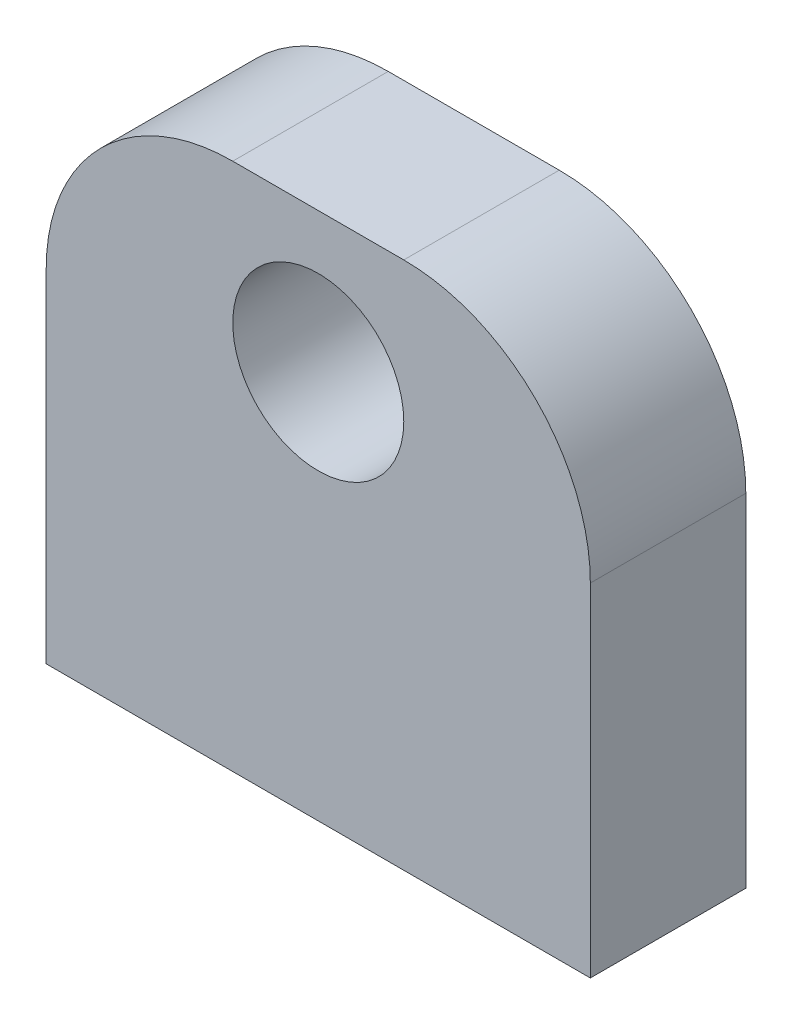
ISO-10303-21;
HEADER;
FILE_DESCRIPTION(('STEP AP214'),'2;1');
FILE_NAME('part.step','',(''),(''),'','','');
FILE_SCHEMA(('AUTOMOTIVE_DESIGN { 1 0 10303 214 1 1 1 1 }'));
ENDSEC;
DATA;
#1=APPLICATION_CONTEXT('core data for automotive mechanical design processes');
#2=APPLICATION_PROTOCOL_DEFINITION('international standard','automotive_design',2000,#1);
#3=PRODUCT_CONTEXT('',#1,'mechanical');
#4=PRODUCT('Part','Part','',(#3));
#5=PRODUCT_RELATED_PRODUCT_CATEGORY('part','',(#4));
#6=PRODUCT_DEFINITION_FORMATION('','',#4);
#7=PRODUCT_DEFINITION_CONTEXT('part definition',#1,'design');
#8=PRODUCT_DEFINITION('design','',#6,#7);
#9=PRODUCT_DEFINITION_SHAPE('','',#8);
#10=(LENGTH_UNIT() NAMED_UNIT(*) SI_UNIT(.MILLI.,.METRE.));
#11=(NAMED_UNIT(*) PLANE_ANGLE_UNIT() SI_UNIT($,.RADIAN.));
#12=(NAMED_UNIT(*) SI_UNIT($,.STERADIAN.) SOLID_ANGLE_UNIT());
#13=UNCERTAINTY_MEASURE_WITH_UNIT(LENGTH_MEASURE(1.E-05),#10,'distance_accuracy_value','');
#14=(GEOMETRIC_REPRESENTATION_CONTEXT(3) GLOBAL_UNCERTAINTY_ASSIGNED_CONTEXT((#13)) GLOBAL_UNIT_ASSIGNED_CONTEXT((#10,
#11,#12)) REPRESENTATION_CONTEXT('',''));
#15=CARTESIAN_POINT('',(0.,0.,0.));
#16=DIRECTION('',(0.,0.,1.));
#17=DIRECTION('',(1.,0.,0.));
#18=AXIS2_PLACEMENT_3D('',#15,#16,#17);
#19=CARTESIAN_POINT('',(-16.3353241489162,34.,-9.14482917573461));
#20=DIRECTION('',(1.,0.,0.));
#21=DIRECTION('',(0.,0.,-1.));
#22=AXIS2_PLACEMENT_3D('',#19,#20,#21);
#23=PLANE('',#22);
#24=DIRECTION('',(0.,-1.,0.));
#25=VECTOR('',#24,1.);
#26=CARTESIAN_POINT('',(-16.3353241489162,34.,0.855170824265387));
#27=LINE('',#26,#25);
#28=CARTESIAN_POINT('',(-16.3353241489162,22.,0.855170824265387));
#29=VERTEX_POINT('',#28);
#30=CARTESIAN_POINT('',(-16.3353241489162,0.,0.855170824265387));
#31=VERTEX_POINT('',#30);
#32=EDGE_CURVE('E84',#29,#31,#27,.T.);
#33=ORIENTED_EDGE('',*,*,#32,.F.);
#34=DIRECTION('',(0.,0.,1.));
#35=VECTOR('',#34,1.);
#36=CARTESIAN_POINT('',(-16.3353241489162,22.,-9.14482917573461));
#37=LINE('',#36,#35);
#38=CARTESIAN_POINT('',(-16.3353241489162,22.,-9.14482917573461));
#39=VERTEX_POINT('',#38);
#40=EDGE_CURVE('E11',#29,#39,#37,.F.);
#41=ORIENTED_EDGE('',*,*,#40,.T.);
#42=DIRECTION('',(0.,-1.,0.));
#43=VECTOR('',#42,1.);
#44=CARTESIAN_POINT('',(-16.3353241489162,34.,-9.14482917573461));
#45=LINE('',#44,#43);
#46=CARTESIAN_POINT('',(-16.3353241489162,0.,-9.14482917573461));
#47=VERTEX_POINT('',#46);
#48=EDGE_CURVE('E104',#39,#47,#45,.T.);
#49=ORIENTED_EDGE('',*,*,#48,.T.);
#50=DIRECTION('',(0.,0.,1.));
#51=VECTOR('',#50,1.);
#52=CARTESIAN_POINT('',(-16.3353241489162,0.,-9.14482917573461));
#53=LINE('',#52,#51);
#54=EDGE_CURVE('E99',#47,#31,#53,.T.);
#55=ORIENTED_EDGE('',*,*,#54,.T.);
#56=EDGE_LOOP('',(#33,#41,#49,#55));
#57=FACE_BOUND('',#56,.T.);
#58=ADVANCED_FACE('F33',(#57),#23,.F.);
#59=CARTESIAN_POINT('',(-16.3353241489162,34.,0.855170824265387));
#60=DIRECTION('',(0.,0.,-1.));
#61=DIRECTION('',(-1.,0.,0.));
#62=AXIS2_PLACEMENT_3D('',#59,#60,#61);
#63=PLANE('',#62);
#64=CARTESIAN_POINT('',(1.16467585108376,25.,0.855170824265387));
#65=DIRECTION('',(0.,0.,1.));
#66=DIRECTION('',(1.,0.,0.));
#67=AXIS2_PLACEMENT_3D('',#64,#65,#66);
#68=CIRCLE('',#67,5.5);
#69=CARTESIAN_POINT('',(6.66467585108376,25.,0.855170824265387));
#70=VERTEX_POINT('',#69);
#71=EDGE_CURVE('E109',#70,#70,#68,.T.);
#72=ORIENTED_EDGE('',*,*,#71,.F.);
#73=EDGE_LOOP('',(#72));
#74=FACE_BOUND('',#73,.T.);
#75=DIRECTION('',(0.,-1.,0.));
#76=VECTOR('',#75,1.);
#77=CARTESIAN_POINT('',(18.6646758510838,34.,0.855170824265387));
#78=LINE('',#77,#76);
#79=CARTESIAN_POINT('',(18.6646758510838,22.,0.855170824265387));
#80=VERTEX_POINT('',#79);
#81=CARTESIAN_POINT('',(18.6646758510838,0.,0.855170824265387));
#82=VERTEX_POINT('',#81);
#83=EDGE_CURVE('E93',#80,#82,#78,.T.);
#84=ORIENTED_EDGE('',*,*,#83,.F.);
#85=CARTESIAN_POINT('',(6.66467585108376,22.,0.855170824265387));
#86=DIRECTION('',(0.,0.,-1.));
#87=DIRECTION('',(-1.,0.,0.));
#88=AXIS2_PLACEMENT_3D('',#85,#86,#87);
#89=CIRCLE('',#88,12.);
#90=CARTESIAN_POINT('',(6.66467585108376,34.,0.855170824265387));
#91=VERTEX_POINT('',#90);
#92=EDGE_CURVE('E41',#80,#91,#89,.F.);
#93=ORIENTED_EDGE('',*,*,#92,.T.);
#94=DIRECTION('',(1.,0.,0.));
#95=VECTOR('',#94,1.);
#96=CARTESIAN_POINT('',(-16.3353241489162,34.,0.855170824265387));
#97=LINE('',#96,#95);
#98=CARTESIAN_POINT('',(-4.33532414891625,34.,0.855170824265387));
#99=VERTEX_POINT('',#98);
#100=EDGE_CURVE('E118',#99,#91,#97,.T.);
#101=ORIENTED_EDGE('',*,*,#100,.F.);
#102=CARTESIAN_POINT('',(-4.33532414891625,22.,0.855170824265387));
#103=DIRECTION('',(0.,0.,-1.));
#104=DIRECTION('',(-1.,0.,0.));
#105=AXIS2_PLACEMENT_3D('',#102,#103,#104);
#106=CIRCLE('',#105,12.);
#107=EDGE_CURVE('E48',#99,#29,#106,.F.);
#108=ORIENTED_EDGE('',*,*,#107,.T.);
#109=ORIENTED_EDGE('',*,*,#32,.T.);
#110=DIRECTION('',(1.,0.,0.));
#111=VECTOR('',#110,1.);
#112=CARTESIAN_POINT('',(-16.3353241489162,0.,0.855170824265387));
#113=LINE('',#112,#111);
#114=EDGE_CURVE('E87',#31,#82,#113,.T.);
#115=ORIENTED_EDGE('',*,*,#114,.T.);
#116=EDGE_LOOP('',(#84,#93,#101,#108,#109,#115));
#117=FACE_BOUND('',#116,.T.);
#118=ADVANCED_FACE('F86',(#74,#117),#63,.F.);
#119=CARTESIAN_POINT('',(18.6646758510838,34.,-9.14482917573461));
#120=DIRECTION('',(-1.,0.,0.));
#121=DIRECTION('',(0.,0.,1.));
#122=AXIS2_PLACEMENT_3D('',#119,#120,#121);
#123=PLANE('',#122);
#124=DIRECTION('',(0.,-1.,0.));
#125=VECTOR('',#124,1.);
#126=CARTESIAN_POINT('',(18.6646758510838,34.,-9.14482917573461));
#127=LINE('',#126,#125);
#128=CARTESIAN_POINT('',(18.6646758510838,22.,-9.14482917573461));
#129=VERTEX_POINT('',#128);
#130=CARTESIAN_POINT('',(18.6646758510838,0.,-9.14482917573461));
#131=VERTEX_POINT('',#130);
#132=EDGE_CURVE('E120',#129,#131,#127,.T.);
#133=ORIENTED_EDGE('',*,*,#132,.F.);
#134=DIRECTION('',(0.,0.,-1.));
#135=VECTOR('',#134,1.);
#136=CARTESIAN_POINT('',(18.6646758510838,22.,0.855170824265387));
#137=LINE('',#136,#135);
#138=EDGE_CURVE('E56',#129,#80,#137,.F.);
#139=ORIENTED_EDGE('',*,*,#138,.T.);
#140=ORIENTED_EDGE('',*,*,#83,.T.);
#141=DIRECTION('',(0.,0.,-1.));
#142=VECTOR('',#141,1.);
#143=CARTESIAN_POINT('',(18.6646758510838,0.,-9.14482917573461));
#144=LINE('',#143,#142);
#145=EDGE_CURVE('E101',#82,#131,#144,.T.);
#146=ORIENTED_EDGE('',*,*,#145,.T.);
#147=EDGE_LOOP('',(#133,#139,#140,#146));
#148=FACE_BOUND('',#147,.T.);
#149=ADVANCED_FACE('F145',(#148),#123,.F.);
#150=CARTESIAN_POINT('',(-16.3353241489162,34.,-9.14482917573461));
#151=DIRECTION('',(0.,0.,1.));
#152=DIRECTION('',(1.,0.,0.));
#153=AXIS2_PLACEMENT_3D('',#150,#151,#152);
#154=PLANE('',#153);
#155=CARTESIAN_POINT('',(1.16467585108376,25.,-9.14482917573461));
#156=DIRECTION('',(0.,0.,1.));
#157=DIRECTION('',(1.,0.,0.));
#158=AXIS2_PLACEMENT_3D('',#155,#156,#157);
#159=CIRCLE('',#158,5.5);
#160=CARTESIAN_POINT('',(6.66467585108376,25.,-9.14482917573461));
#161=VERTEX_POINT('',#160);
#162=EDGE_CURVE('E106',#161,#161,#159,.T.);
#163=ORIENTED_EDGE('',*,*,#162,.T.);
#164=EDGE_LOOP('',(#163));
#165=FACE_BOUND('',#164,.T.);
#166=DIRECTION('',(-1.,0.,0.));
#167=VECTOR('',#166,1.);
#168=CARTESIAN_POINT('',(-16.3353241489162,34.,-9.14482917573461));
#169=LINE('',#168,#167);
#170=CARTESIAN_POINT('',(6.66467585108376,34.,-9.14482917573461));
#171=VERTEX_POINT('',#170);
#172=CARTESIAN_POINT('',(-4.33532414891625,34.,-9.14482917573461));
#173=VERTEX_POINT('',#172);
#174=EDGE_CURVE('E112',#171,#173,#169,.T.);
#175=ORIENTED_EDGE('',*,*,#174,.F.);
#176=CARTESIAN_POINT('',(6.66467585108376,22.,-9.14482917573461));
#177=DIRECTION('',(0.,0.,1.));
#178=DIRECTION('',(1.,0.,0.));
#179=AXIS2_PLACEMENT_3D('',#176,#177,#178);
#180=CIRCLE('',#179,12.);
#181=EDGE_CURVE('E130',#171,#129,#180,.F.);
#182=ORIENTED_EDGE('',*,*,#181,.T.);
#183=ORIENTED_EDGE('',*,*,#132,.T.);
#184=DIRECTION('',(-1.,0.,0.));
#185=VECTOR('',#184,1.);
#186=CARTESIAN_POINT('',(-16.3353241489162,0.,-9.14482917573461));
#187=LINE('',#186,#185);
#188=EDGE_CURVE('E116',#131,#47,#187,.T.);
#189=ORIENTED_EDGE('',*,*,#188,.T.);
#190=ORIENTED_EDGE('',*,*,#48,.F.);
#191=CARTESIAN_POINT('',(-4.33532414891625,22.,-9.14482917573461));
#192=DIRECTION('',(0.,0.,1.));
#193=DIRECTION('',(1.,0.,0.));
#194=AXIS2_PLACEMENT_3D('',#191,#192,#193);
#195=CIRCLE('',#194,12.);
#196=EDGE_CURVE('E128',#39,#173,#195,.F.);
#197=ORIENTED_EDGE('',*,*,#196,.T.);
#198=EDGE_LOOP('',(#175,#182,#183,#189,#190,#197));
#199=FACE_BOUND('',#198,.T.);
#200=ADVANCED_FACE('F144',(#165,#199),#154,.F.);
#201=CARTESIAN_POINT('',(0.,34.,0.));
#202=DIRECTION('',(0.,1.,0.));
#203=DIRECTION('',(0.,0.,1.));
#204=AXIS2_PLACEMENT_3D('',#201,#202,#203);
#205=PLANE('',#204);
#206=ORIENTED_EDGE('',*,*,#100,.T.);
#207=DIRECTION('',(0.,0.,-1.));
#208=VECTOR('',#207,1.);
#209=CARTESIAN_POINT('',(6.66467585108376,34.,-9.14482917573461));
#210=LINE('',#209,#208);
#211=EDGE_CURVE('E125',#91,#171,#210,.T.);
#212=ORIENTED_EDGE('',*,*,#211,.T.);
#213=ORIENTED_EDGE('',*,*,#174,.T.);
#214=DIRECTION('',(0.,0.,1.));
#215=VECTOR('',#214,1.);
#216=CARTESIAN_POINT('',(-4.33532414891625,34.,0.855170824265383));
#217=LINE('',#216,#215);
#218=EDGE_CURVE('E92',#173,#99,#217,.T.);
#219=ORIENTED_EDGE('',*,*,#218,.T.);
#220=EDGE_LOOP('',(#206,#212,#213,#219));
#221=FACE_BOUND('',#220,.T.);
#222=ADVANCED_FACE('F138',(#221),#205,.T.);
#223=CARTESIAN_POINT('',(0.,0.,0.));
#224=DIRECTION('',(0.,1.,0.));
#225=DIRECTION('',(0.,0.,1.));
#226=AXIS2_PLACEMENT_3D('',#223,#224,#225);
#227=PLANE('',#226);
#228=CARTESIAN_POINT('',(10.6646758510838,0.,-4.14482917573461));
#229=DIRECTION('',(0.,-1.,0.));
#230=DIRECTION('',(0.,0.,-1.));
#231=AXIS2_PLACEMENT_3D('',#228,#229,#230);
#232=CIRCLE('',#231,1.75);
#233=CARTESIAN_POINT('',(10.6646758510838,0.,-5.89482917573461));
#234=VERTEX_POINT('',#233);
#235=EDGE_CURVE('E195',#234,#234,#232,.T.);
#236=ORIENTED_EDGE('',*,*,#235,.F.);
#237=EDGE_LOOP('',(#236));
#238=FACE_BOUND('',#237,.T.);
#239=CARTESIAN_POINT('',(-8.33532414891625,0.,-4.14482917573461));
#240=DIRECTION('',(0.,-1.,0.));
#241=DIRECTION('',(0.,0.,-1.));
#242=AXIS2_PLACEMENT_3D('',#239,#240,#241);
#243=CIRCLE('',#242,1.75);
#244=CARTESIAN_POINT('',(-8.33532414891625,0.,-5.89482917573461));
#245=VERTEX_POINT('',#244);
#246=EDGE_CURVE('E194',#245,#245,#243,.T.);
#247=ORIENTED_EDGE('',*,*,#246,.F.);
#248=EDGE_LOOP('',(#247));
#249=FACE_BOUND('',#248,.T.);
#250=ORIENTED_EDGE('',*,*,#54,.F.);
#251=ORIENTED_EDGE('',*,*,#188,.F.);
#252=ORIENTED_EDGE('',*,*,#145,.F.);
#253=ORIENTED_EDGE('',*,*,#114,.F.);
#254=EDGE_LOOP('',(#250,#251,#252,#253));
#255=FACE_BOUND('',#254,.T.);
#256=ADVANCED_FACE('F97',(#238,#249,#255),#227,.F.);
#257=CARTESIAN_POINT('',(1.16467585108376,25.,-9.14482917573461));
#258=DIRECTION('',(0.,0.,1.));
#259=DIRECTION('',(1.,0.,0.));
#260=AXIS2_PLACEMENT_3D('',#257,#258,#259);
#261=CYLINDRICAL_SURFACE('',#260,5.5);
#262=ORIENTED_EDGE('',*,*,#162,.F.);
#263=EDGE_LOOP('',(#262));
#264=FACE_BOUND('',#263,.T.);
#265=ORIENTED_EDGE('',*,*,#71,.T.);
#266=EDGE_LOOP('',(#265));
#267=FACE_BOUND('',#266,.T.);
#268=ADVANCED_FACE('F168',(#264,#267),#261,.F.);
#269=CARTESIAN_POINT('',(-8.33532414891625,10.,-4.14482917573461));
#270=DIRECTION('',(0.,-1.,0.));
#271=DIRECTION('',(0.,0.,-1.));
#272=AXIS2_PLACEMENT_3D('',#269,#270,#271);
#273=CYLINDRICAL_SURFACE('',#272,1.75);
#274=CARTESIAN_POINT('',(-8.33532414891625,10.,-4.14482917573461));
#275=DIRECTION('',(0.,-1.,0.));
#276=DIRECTION('',(0.,0.,-1.));
#277=AXIS2_PLACEMENT_3D('',#274,#275,#276);
#278=CIRCLE('',#277,1.75);
#279=CARTESIAN_POINT('',(-8.33532414891625,10.,-5.89482917573461));
#280=VERTEX_POINT('',#279);
#281=EDGE_CURVE('E198',#280,#280,#278,.T.);
#282=ORIENTED_EDGE('',*,*,#281,.F.);
#283=EDGE_LOOP('',(#282));
#284=FACE_BOUND('',#283,.T.);
#285=ORIENTED_EDGE('',*,*,#246,.T.);
#286=EDGE_LOOP('',(#285));
#287=FACE_BOUND('',#286,.T.);
#288=ADVANCED_FACE('F174',(#284,#287),#273,.F.);
#289=CARTESIAN_POINT('',(-8.33532414891625,10.,-4.14482917573461));
#290=DIRECTION('',(0.,-1.,0.));
#291=DIRECTION('',(0.,0.,-1.));
#292=AXIS2_PLACEMENT_3D('',#289,#290,#291);
#293=PLANE('',#292);
#294=ORIENTED_EDGE('',*,*,#281,.T.);
#295=EDGE_LOOP('',(#294));
#296=FACE_BOUND('',#295,.T.);
#297=ADVANCED_FACE('F178',(#296),#293,.T.);
#298=CARTESIAN_POINT('',(10.6646758510838,10.,-4.14482917573461));
#299=DIRECTION('',(0.,-1.,0.));
#300=DIRECTION('',(0.,0.,-1.));
#301=AXIS2_PLACEMENT_3D('',#298,#299,#300);
#302=CYLINDRICAL_SURFACE('',#301,1.75);
#303=CARTESIAN_POINT('',(10.6646758510838,10.,-4.14482917573461));
#304=DIRECTION('',(0.,-1.,0.));
#305=DIRECTION('',(0.,0.,-1.));
#306=AXIS2_PLACEMENT_3D('',#303,#304,#305);
#307=CIRCLE('',#306,1.75);
#308=CARTESIAN_POINT('',(10.6646758510838,10.,-5.89482917573461));
#309=VERTEX_POINT('',#308);
#310=EDGE_CURVE('E193',#309,#309,#307,.T.);
#311=ORIENTED_EDGE('',*,*,#310,.F.);
#312=EDGE_LOOP('',(#311));
#313=FACE_BOUND('',#312,.T.);
#314=ORIENTED_EDGE('',*,*,#235,.T.);
#315=EDGE_LOOP('',(#314));
#316=FACE_BOUND('',#315,.T.);
#317=ADVANCED_FACE('F182',(#313,#316),#302,.F.);
#318=CARTESIAN_POINT('',(10.6646758510838,10.,-4.14482917573461));
#319=DIRECTION('',(0.,-1.,0.));
#320=DIRECTION('',(0.,0.,-1.));
#321=AXIS2_PLACEMENT_3D('',#318,#319,#320);
#322=PLANE('',#321);
#323=ORIENTED_EDGE('',*,*,#310,.T.);
#324=EDGE_LOOP('',(#323));
#325=FACE_BOUND('',#324,.T.);
#326=ADVANCED_FACE('F152',(#325),#322,.T.);
#327=CARTESIAN_POINT('',(6.66467585108376,22.,0.));
#328=DIRECTION('',(0.,0.,1.));
#329=DIRECTION('',(1.,0.,0.));
#330=AXIS2_PLACEMENT_3D('',#327,#328,#329);
#331=CYLINDRICAL_SURFACE('',#330,12.);
#332=ORIENTED_EDGE('',*,*,#92,.F.);
#333=ORIENTED_EDGE('',*,*,#138,.F.);
#334=ORIENTED_EDGE('',*,*,#181,.F.);
#335=ORIENTED_EDGE('',*,*,#211,.F.);
#336=EDGE_LOOP('',(#332,#333,#334,#335));
#337=FACE_BOUND('',#336,.T.);
#338=ADVANCED_FACE('F142',(#337),#331,.T.);
#339=CARTESIAN_POINT('',(-4.33532414891625,22.,0.));
#340=DIRECTION('',(0.,0.,-1.));
#341=DIRECTION('',(-1.,0.,0.));
#342=AXIS2_PLACEMENT_3D('',#339,#340,#341);
#343=CYLINDRICAL_SURFACE('',#342,12.);
#344=ORIENTED_EDGE('',*,*,#196,.F.);
#345=ORIENTED_EDGE('',*,*,#40,.F.);
#346=ORIENTED_EDGE('',*,*,#107,.F.);
#347=ORIENTED_EDGE('',*,*,#218,.F.);
#348=EDGE_LOOP('',(#344,#345,#346,#347));
#349=FACE_BOUND('',#348,.T.);
#350=ADVANCED_FACE('F35',(#349),#343,.T.);
#351=CLOSED_SHELL('',(#58,#118,#149,#200,#222,#256,#268,#288,#297,#317,#326,#338,#350));
#352=MANIFOLD_SOLID_BREP('B2',#351);
#353=ADVANCED_BREP_SHAPE_REPRESENTATION('',(#18,#352),#14);
#354=SHAPE_DEFINITION_REPRESENTATION(#9,#353);
ENDSEC;
END-ISO-10303-21;
